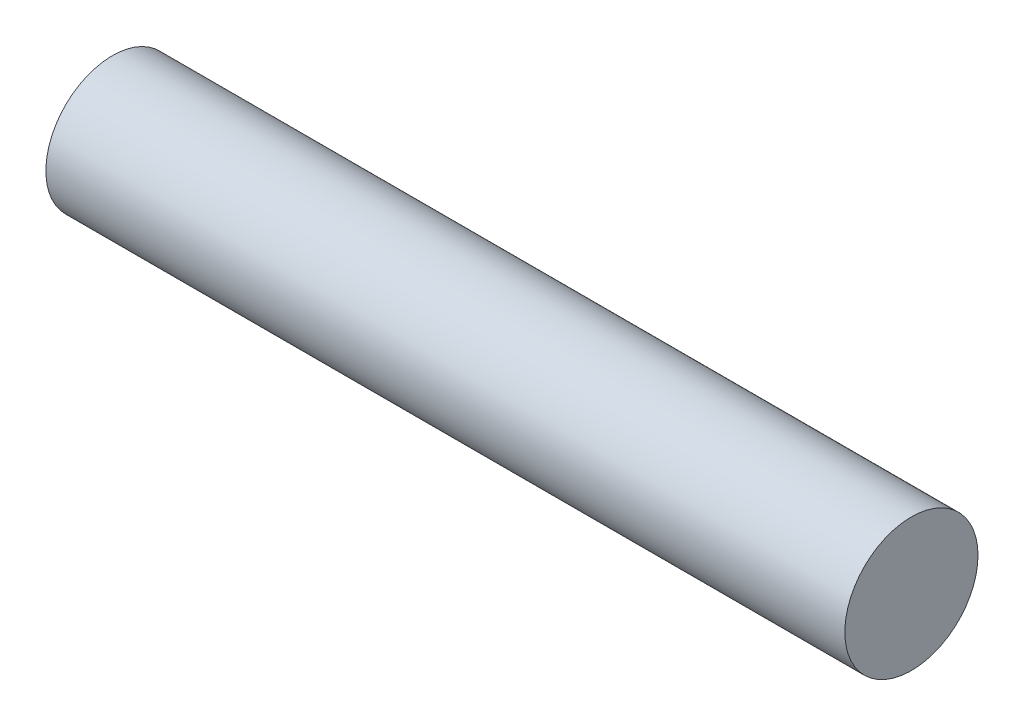
ISO-10303-21;
HEADER;
FILE_DESCRIPTION(('STEP AP214'),'2;1');
FILE_NAME('part.step','',(''),(''),'','','');
FILE_SCHEMA(('AUTOMOTIVE_DESIGN { 1 0 10303 214 1 1 1 1 }'));
ENDSEC;
DATA;
#1=APPLICATION_CONTEXT('core data for automotive mechanical design processes');
#2=APPLICATION_PROTOCOL_DEFINITION('international standard','automotive_design',2000,#1);
#3=PRODUCT_CONTEXT('',#1,'mechanical');
#4=PRODUCT('Part','Part','',(#3));
#5=PRODUCT_RELATED_PRODUCT_CATEGORY('part','',(#4));
#6=PRODUCT_DEFINITION_FORMATION('','',#4);
#7=PRODUCT_DEFINITION_CONTEXT('part definition',#1,'design');
#8=PRODUCT_DEFINITION('design','',#6,#7);
#9=PRODUCT_DEFINITION_SHAPE('','',#8);
#10=(LENGTH_UNIT() NAMED_UNIT(*) SI_UNIT(.MILLI.,.METRE.));
#11=(NAMED_UNIT(*) PLANE_ANGLE_UNIT() SI_UNIT($,.RADIAN.));
#12=(NAMED_UNIT(*) SI_UNIT($,.STERADIAN.) SOLID_ANGLE_UNIT());
#13=UNCERTAINTY_MEASURE_WITH_UNIT(LENGTH_MEASURE(1.E-05),#10,'distance_accuracy_value','');
#14=(GEOMETRIC_REPRESENTATION_CONTEXT(3) GLOBAL_UNCERTAINTY_ASSIGNED_CONTEXT((#13)) GLOBAL_UNIT_ASSIGNED_CONTEXT((#10,
#11,#12)) REPRESENTATION_CONTEXT('',''));
#15=CARTESIAN_POINT('',(0.,0.,0.));
#16=DIRECTION('',(0.,0.,1.));
#17=DIRECTION('',(1.,0.,0.));
#18=AXIS2_PLACEMENT_3D('',#15,#16,#17);
#19=CARTESIAN_POINT('',(76.2,0.,0.));
#20=DIRECTION('',(-1.,0.,0.));
#21=DIRECTION('',(0.,0.,1.));
#22=AXIS2_PLACEMENT_3D('',#19,#20,#21);
#23=CYLINDRICAL_SURFACE('',#22,6.35);
#24=CARTESIAN_POINT('',(76.2,0.,0.));
#25=DIRECTION('',(1.,0.,0.));
#26=DIRECTION('',(0.,0.,-1.));
#27=AXIS2_PLACEMENT_3D('',#24,#25,#26);
#28=CIRCLE('',#27,6.35);
#29=CARTESIAN_POINT('',(76.2,0.,-6.35));
#30=VERTEX_POINT('',#29);
#31=EDGE_CURVE('E10',#30,#30,#28,.T.);
#32=ORIENTED_EDGE('',*,*,#31,.F.);
#33=EDGE_LOOP('',(#32));
#34=FACE_BOUND('',#33,.T.);
#35=CARTESIAN_POINT('',(0.,0.,0.));
#36=DIRECTION('',(1.,0.,0.));
#37=DIRECTION('',(0.,0.,-1.));
#38=AXIS2_PLACEMENT_3D('',#35,#36,#37);
#39=CIRCLE('',#38,6.35);
#40=CARTESIAN_POINT('',(0.,0.,-6.35));
#41=VERTEX_POINT('',#40);
#42=EDGE_CURVE('E33',#41,#41,#39,.T.);
#43=ORIENTED_EDGE('',*,*,#42,.T.);
#44=EDGE_LOOP('',(#43));
#45=FACE_BOUND('',#44,.T.);
#46=ADVANCED_FACE('F30',(#34,#45),#23,.T.);
#47=CARTESIAN_POINT('',(76.2,0.,0.));
#48=DIRECTION('',(1.,0.,0.));
#49=DIRECTION('',(0.,0.,-1.));
#50=AXIS2_PLACEMENT_3D('',#47,#48,#49);
#51=PLANE('',#50);
#52=ORIENTED_EDGE('',*,*,#31,.T.);
#53=EDGE_LOOP('',(#52));
#54=FACE_BOUND('',#53,.T.);
#55=ADVANCED_FACE('F45',(#54),#51,.T.);
#56=CARTESIAN_POINT('',(0.,0.,0.));
#57=DIRECTION('',(1.,0.,0.));
#58=DIRECTION('',(0.,0.,-1.));
#59=AXIS2_PLACEMENT_3D('',#56,#57,#58);
#60=PLANE('',#59);
#61=ORIENTED_EDGE('',*,*,#42,.F.);
#62=EDGE_LOOP('',(#61));
#63=FACE_BOUND('',#62,.T.);
#64=ADVANCED_FACE('F43',(#63),#60,.F.);
#65=CLOSED_SHELL('',(#46,#55,#64));
#66=MANIFOLD_SOLID_BREP('B2',#65);
#67=ADVANCED_BREP_SHAPE_REPRESENTATION('',(#18,#66),#14);
#68=SHAPE_DEFINITION_REPRESENTATION(#9,#67);
ENDSEC;
END-ISO-10303-21;
